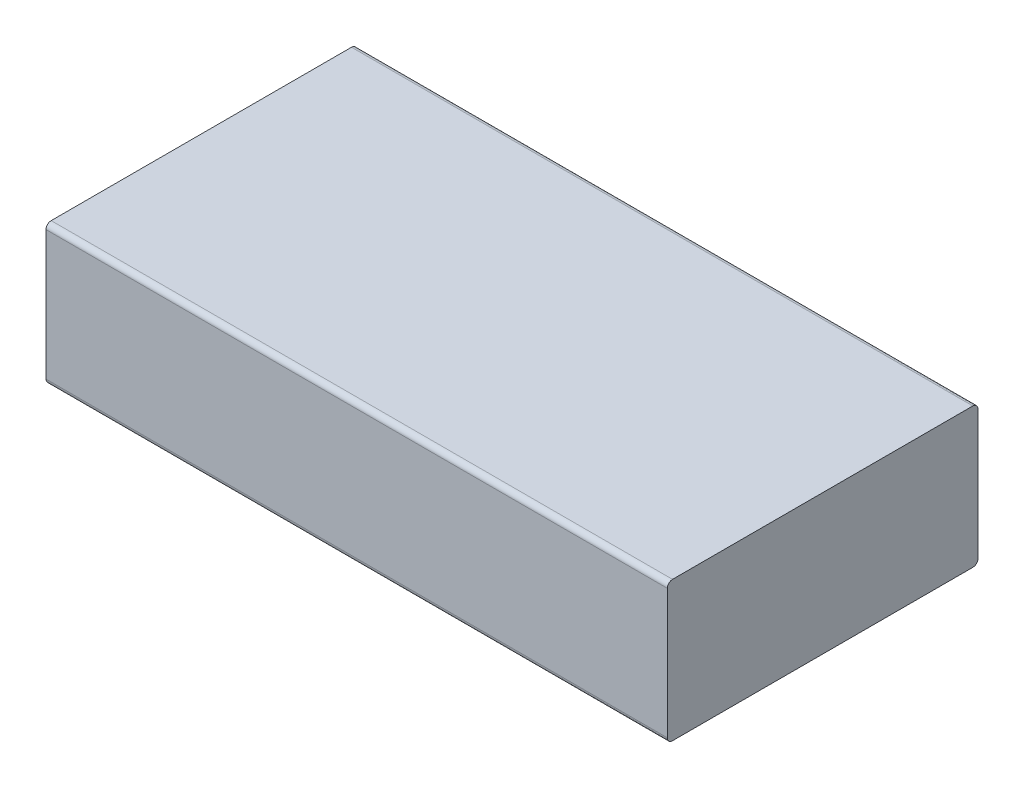
ISO-10303-21;
HEADER;
FILE_DESCRIPTION(('STEP AP214'),'2;1');
FILE_NAME('part.step','',(''),(''),'','','');
FILE_SCHEMA(('AUTOMOTIVE_DESIGN { 1 0 10303 214 1 1 1 1 }'));
ENDSEC;
DATA;
#1=APPLICATION_CONTEXT('core data for automotive mechanical design processes');
#2=APPLICATION_PROTOCOL_DEFINITION('international standard','automotive_design',2000,#1);
#3=PRODUCT_CONTEXT('',#1,'mechanical');
#4=PRODUCT('Part','Part','',(#3));
#5=PRODUCT_RELATED_PRODUCT_CATEGORY('part','',(#4));
#6=PRODUCT_DEFINITION_FORMATION('','',#4);
#7=PRODUCT_DEFINITION_CONTEXT('part definition',#1,'design');
#8=PRODUCT_DEFINITION('design','',#6,#7);
#9=PRODUCT_DEFINITION_SHAPE('','',#8);
#10=(LENGTH_UNIT() NAMED_UNIT(*) SI_UNIT(.MILLI.,.METRE.));
#11=(NAMED_UNIT(*) PLANE_ANGLE_UNIT() SI_UNIT($,.RADIAN.));
#12=(NAMED_UNIT(*) SI_UNIT($,.STERADIAN.) SOLID_ANGLE_UNIT());
#13=UNCERTAINTY_MEASURE_WITH_UNIT(LENGTH_MEASURE(1.E-05),#10,'distance_accuracy_value','');
#14=(GEOMETRIC_REPRESENTATION_CONTEXT(3) GLOBAL_UNCERTAINTY_ASSIGNED_CONTEXT((#13)) GLOBAL_UNIT_ASSIGNED_CONTEXT((#10,
#11,#12)) REPRESENTATION_CONTEXT('',''));
#15=CARTESIAN_POINT('',(0.,0.,0.));
#16=DIRECTION('',(0.,0.,1.));
#17=DIRECTION('',(1.,0.,0.));
#18=AXIS2_PLACEMENT_3D('',#15,#16,#17);
#19=CARTESIAN_POINT('',(60.,0.,0.));
#20=DIRECTION('',(0.,0.,-1.));
#21=DIRECTION('',(-1.,0.,0.));
#22=AXIS2_PLACEMENT_3D('',#19,#20,#21);
#23=PLANE('',#22);
#24=DIRECTION('',(0.,-1.,0.));
#25=VECTOR('',#24,1.);
#26=CARTESIAN_POINT('',(-60.,0.,0.));
#27=LINE('',#26,#25);
#28=CARTESIAN_POINT('',(-60.,26.,0.));
#29=VERTEX_POINT('',#28);
#30=CARTESIAN_POINT('',(-60.,1.,0.));
#31=VERTEX_POINT('',#30);
#32=EDGE_CURVE('E141',#29,#31,#27,.T.);
#33=ORIENTED_EDGE('',*,*,#32,.T.);
#34=DIRECTION('',(-1.,0.,0.));
#35=VECTOR('',#34,1.);
#36=CARTESIAN_POINT('',(60.,1.,0.));
#37=LINE('',#36,#35);
#38=CARTESIAN_POINT('',(60.,1.,0.));
#39=VERTEX_POINT('',#38);
#40=EDGE_CURVE('E11',#31,#39,#37,.F.);
#41=ORIENTED_EDGE('',*,*,#40,.T.);
#42=DIRECTION('',(0.,-1.,0.));
#43=VECTOR('',#42,1.);
#44=CARTESIAN_POINT('',(60.,0.,0.));
#45=LINE('',#44,#43);
#46=CARTESIAN_POINT('',(60.,26.,0.));
#47=VERTEX_POINT('',#46);
#48=EDGE_CURVE('E139',#47,#39,#45,.T.);
#49=ORIENTED_EDGE('',*,*,#48,.F.);
#50=DIRECTION('',(-1.,0.,0.));
#51=VECTOR('',#50,1.);
#52=CARTESIAN_POINT('',(60.,26.,0.));
#53=LINE('',#52,#51);
#54=EDGE_CURVE('E48',#47,#29,#53,.T.);
#55=ORIENTED_EDGE('',*,*,#54,.T.);
#56=EDGE_LOOP('',(#33,#41,#49,#55));
#57=FACE_BOUND('',#56,.T.);
#58=ADVANCED_FACE('F39',(#57),#23,.F.);
#59=CARTESIAN_POINT('',(60.,0.,0.));
#60=DIRECTION('',(0.,1.,0.));
#61=DIRECTION('',(0.,0.,1.));
#62=AXIS2_PLACEMENT_3D('',#59,#60,#61);
#63=PLANE('',#62);
#64=DIRECTION('',(0.,0.,-1.));
#65=VECTOR('',#64,1.);
#66=CARTESIAN_POINT('',(-60.,0.,0.));
#67=LINE('',#66,#65);
#68=CARTESIAN_POINT('',(-60.,0.,-1.));
#69=VERTEX_POINT('',#68);
#70=CARTESIAN_POINT('',(-60.,0.,-59.));
#71=VERTEX_POINT('',#70);
#72=EDGE_CURVE('E135',#69,#71,#67,.T.);
#73=ORIENTED_EDGE('',*,*,#72,.T.);
#74=DIRECTION('',(-1.,0.,0.));
#75=VECTOR('',#74,1.);
#76=CARTESIAN_POINT('',(60.,0.,-59.));
#77=LINE('',#76,#75);
#78=CARTESIAN_POINT('',(60.,0.,-59.));
#79=VERTEX_POINT('',#78);
#80=EDGE_CURVE('E111',#71,#79,#77,.F.);
#81=ORIENTED_EDGE('',*,*,#80,.T.);
#82=DIRECTION('',(0.,0.,-1.));
#83=VECTOR('',#82,1.);
#84=CARTESIAN_POINT('',(60.,0.,0.));
#85=LINE('',#84,#83);
#86=CARTESIAN_POINT('',(60.,0.,-1.));
#87=VERTEX_POINT('',#86);
#88=EDGE_CURVE('E193',#87,#79,#85,.T.);
#89=ORIENTED_EDGE('',*,*,#88,.F.);
#90=DIRECTION('',(-1.,0.,0.));
#91=VECTOR('',#90,1.);
#92=CARTESIAN_POINT('',(60.,0.,-1.));
#93=LINE('',#92,#91);
#94=EDGE_CURVE('E117',#87,#69,#93,.T.);
#95=ORIENTED_EDGE('',*,*,#94,.T.);
#96=EDGE_LOOP('',(#73,#81,#89,#95));
#97=FACE_BOUND('',#96,.T.);
#98=ADVANCED_FACE('F205',(#97),#63,.F.);
#99=CARTESIAN_POINT('',(60.,0.,-60.));
#100=DIRECTION('',(0.,0.,1.));
#101=DIRECTION('',(1.,0.,0.));
#102=AXIS2_PLACEMENT_3D('',#99,#100,#101);
#103=PLANE('',#102);
#104=DIRECTION('',(0.,1.,0.));
#105=VECTOR('',#104,1.);
#106=CARTESIAN_POINT('',(60.,0.,-60.));
#107=LINE('',#106,#105);
#108=CARTESIAN_POINT('',(60.,1.,-60.));
#109=VERTEX_POINT('',#108);
#110=CARTESIAN_POINT('',(60.,26.,-60.));
#111=VERTEX_POINT('',#110);
#112=EDGE_CURVE('E126',#109,#111,#107,.T.);
#113=ORIENTED_EDGE('',*,*,#112,.F.);
#114=DIRECTION('',(-1.,0.,0.));
#115=VECTOR('',#114,1.);
#116=CARTESIAN_POINT('',(60.,1.,-60.));
#117=LINE('',#116,#115);
#118=CARTESIAN_POINT('',(-60.,1.,-60.));
#119=VERTEX_POINT('',#118);
#120=EDGE_CURVE('E110',#109,#119,#117,.T.);
#121=ORIENTED_EDGE('',*,*,#120,.T.);
#122=DIRECTION('',(0.,1.,0.));
#123=VECTOR('',#122,1.);
#124=CARTESIAN_POINT('',(-60.,0.,-60.));
#125=LINE('',#124,#123);
#126=CARTESIAN_POINT('',(-60.,26.,-60.));
#127=VERTEX_POINT('',#126);
#128=EDGE_CURVE('E124',#119,#127,#125,.T.);
#129=ORIENTED_EDGE('',*,*,#128,.T.);
#130=DIRECTION('',(-1.,0.,0.));
#131=VECTOR('',#130,1.);
#132=CARTESIAN_POINT('',(60.,26.,-60.));
#133=LINE('',#132,#131);
#134=EDGE_CURVE('E129',#127,#111,#133,.F.);
#135=ORIENTED_EDGE('',*,*,#134,.T.);
#136=EDGE_LOOP('',(#113,#121,#129,#135));
#137=FACE_BOUND('',#136,.T.);
#138=ADVANCED_FACE('F123',(#137),#103,.F.);
#139=CARTESIAN_POINT('',(60.,27.,0.));
#140=DIRECTION('',(0.,-1.,0.));
#141=DIRECTION('',(0.,0.,-1.));
#142=AXIS2_PLACEMENT_3D('',#139,#140,#141);
#143=PLANE('',#142);
#144=DIRECTION('',(0.,0.,1.));
#145=VECTOR('',#144,1.);
#146=CARTESIAN_POINT('',(60.,27.,0.));
#147=LINE('',#146,#145);
#148=CARTESIAN_POINT('',(60.,27.,-59.));
#149=VERTEX_POINT('',#148);
#150=CARTESIAN_POINT('',(60.,27.,-1.));
#151=VERTEX_POINT('',#150);
#152=EDGE_CURVE('E146',#149,#151,#147,.T.);
#153=ORIENTED_EDGE('',*,*,#152,.F.);
#154=DIRECTION('',(-1.,0.,0.));
#155=VECTOR('',#154,1.);
#156=CARTESIAN_POINT('',(60.,27.,-59.));
#157=LINE('',#156,#155);
#158=CARTESIAN_POINT('',(-60.,27.,-59.));
#159=VERTEX_POINT('',#158);
#160=EDGE_CURVE('E173',#149,#159,#157,.T.);
#161=ORIENTED_EDGE('',*,*,#160,.T.);
#162=DIRECTION('',(0.,0.,1.));
#163=VECTOR('',#162,1.);
#164=CARTESIAN_POINT('',(-60.,27.,0.));
#165=LINE('',#164,#163);
#166=CARTESIAN_POINT('',(-60.,27.,-1.));
#167=VERTEX_POINT('',#166);
#168=EDGE_CURVE('E134',#159,#167,#165,.T.);
#169=ORIENTED_EDGE('',*,*,#168,.T.);
#170=DIRECTION('',(-1.,0.,0.));
#171=VECTOR('',#170,1.);
#172=CARTESIAN_POINT('',(60.,27.,-1.));
#173=LINE('',#172,#171);
#174=EDGE_CURVE('E55',#167,#151,#173,.F.);
#175=ORIENTED_EDGE('',*,*,#174,.T.);
#176=EDGE_LOOP('',(#153,#161,#169,#175));
#177=FACE_BOUND('',#176,.T.);
#178=ADVANCED_FACE('F209',(#177),#143,.F.);
#179=CARTESIAN_POINT('',(60.,0.,0.));
#180=DIRECTION('',(-1.,0.,0.));
#181=DIRECTION('',(0.,0.,1.));
#182=AXIS2_PLACEMENT_3D('',#179,#180,#181);
#183=PLANE('',#182);
#184=ORIENTED_EDGE('',*,*,#88,.T.);
#185=CARTESIAN_POINT('',(60.,1.,-59.));
#186=DIRECTION('',(-1.,0.,0.));
#187=DIRECTION('',(0.,0.,1.));
#188=AXIS2_PLACEMENT_3D('',#185,#186,#187);
#189=CIRCLE('',#188,1.);
#190=EDGE_CURVE('E168',#79,#109,#189,.F.);
#191=ORIENTED_EDGE('',*,*,#190,.T.);
#192=ORIENTED_EDGE('',*,*,#112,.T.);
#193=CARTESIAN_POINT('',(60.,26.,-59.));
#194=DIRECTION('',(-1.,0.,0.));
#195=DIRECTION('',(0.,0.,1.));
#196=AXIS2_PLACEMENT_3D('',#193,#194,#195);
#197=CIRCLE('',#196,1.);
#198=EDGE_CURVE('E62',#111,#149,#197,.F.);
#199=ORIENTED_EDGE('',*,*,#198,.T.);
#200=ORIENTED_EDGE('',*,*,#152,.T.);
#201=CARTESIAN_POINT('',(60.,26.,-1.));
#202=DIRECTION('',(-1.,0.,0.));
#203=DIRECTION('',(0.,0.,1.));
#204=AXIS2_PLACEMENT_3D('',#201,#202,#203);
#205=CIRCLE('',#204,1.);
#206=EDGE_CURVE('E160',#151,#47,#205,.F.);
#207=ORIENTED_EDGE('',*,*,#206,.T.);
#208=ORIENTED_EDGE('',*,*,#48,.T.);
#209=CARTESIAN_POINT('',(60.,1.,-1.));
#210=DIRECTION('',(-1.,0.,0.));
#211=DIRECTION('',(0.,0.,1.));
#212=AXIS2_PLACEMENT_3D('',#209,#210,#211);
#213=CIRCLE('',#212,1.);
#214=EDGE_CURVE('E163',#39,#87,#213,.F.);
#215=ORIENTED_EDGE('',*,*,#214,.T.);
#216=EDGE_LOOP('',(#184,#191,#192,#199,#200,#207,#208,#215));
#217=FACE_BOUND('',#216,.T.);
#218=ADVANCED_FACE('F199',(#217),#183,.F.);
#219=CARTESIAN_POINT('',(-60.,0.,0.));
#220=DIRECTION('',(-1.,0.,0.));
#221=DIRECTION('',(0.,0.,1.));
#222=AXIS2_PLACEMENT_3D('',#219,#220,#221);
#223=PLANE('',#222);
#224=ORIENTED_EDGE('',*,*,#128,.F.);
#225=CARTESIAN_POINT('',(-60.,1.,-59.));
#226=DIRECTION('',(-1.,0.,0.));
#227=DIRECTION('',(0.,0.,1.));
#228=AXIS2_PLACEMENT_3D('',#225,#226,#227);
#229=CIRCLE('',#228,1.);
#230=EDGE_CURVE('E106',#119,#71,#229,.T.);
#231=ORIENTED_EDGE('',*,*,#230,.T.);
#232=ORIENTED_EDGE('',*,*,#72,.F.);
#233=CARTESIAN_POINT('',(-60.,1.,-1.));
#234=DIRECTION('',(-1.,0.,0.));
#235=DIRECTION('',(0.,0.,1.));
#236=AXIS2_PLACEMENT_3D('',#233,#234,#235);
#237=CIRCLE('',#236,1.);
#238=EDGE_CURVE('E150',#69,#31,#237,.T.);
#239=ORIENTED_EDGE('',*,*,#238,.T.);
#240=ORIENTED_EDGE('',*,*,#32,.F.);
#241=CARTESIAN_POINT('',(-60.,26.,-1.));
#242=DIRECTION('',(-1.,0.,0.));
#243=DIRECTION('',(0.,0.,1.));
#244=AXIS2_PLACEMENT_3D('',#241,#242,#243);
#245=CIRCLE('',#244,1.);
#246=EDGE_CURVE('E128',#29,#167,#245,.T.);
#247=ORIENTED_EDGE('',*,*,#246,.T.);
#248=ORIENTED_EDGE('',*,*,#168,.F.);
#249=CARTESIAN_POINT('',(-60.,26.,-59.));
#250=DIRECTION('',(-1.,0.,0.));
#251=DIRECTION('',(0.,0.,1.));
#252=AXIS2_PLACEMENT_3D('',#249,#250,#251);
#253=CIRCLE('',#252,1.);
#254=EDGE_CURVE('E118',#159,#127,#253,.T.);
#255=ORIENTED_EDGE('',*,*,#254,.T.);
#256=EDGE_LOOP('',(#224,#231,#232,#239,#240,#247,#248,#255));
#257=FACE_BOUND('',#256,.T.);
#258=ADVANCED_FACE('F131',(#257),#223,.T.);
#259=CARTESIAN_POINT('',(60.,1.,-59.));
#260=DIRECTION('',(-1.,0.,0.));
#261=DIRECTION('',(0.,0.,1.));
#262=AXIS2_PLACEMENT_3D('',#259,#260,#261);
#263=CYLINDRICAL_SURFACE('',#262,1.);
#264=ORIENTED_EDGE('',*,*,#190,.F.);
#265=ORIENTED_EDGE('',*,*,#80,.F.);
#266=ORIENTED_EDGE('',*,*,#230,.F.);
#267=ORIENTED_EDGE('',*,*,#120,.F.);
#268=EDGE_LOOP('',(#264,#265,#266,#267));
#269=FACE_BOUND('',#268,.T.);
#270=ADVANCED_FACE('F109',(#269),#263,.T.);
#271=CARTESIAN_POINT('',(60.,26.,-59.));
#272=DIRECTION('',(-1.,0.,0.));
#273=DIRECTION('',(0.,0.,1.));
#274=AXIS2_PLACEMENT_3D('',#271,#272,#273);
#275=CYLINDRICAL_SURFACE('',#274,1.);
#276=ORIENTED_EDGE('',*,*,#198,.F.);
#277=ORIENTED_EDGE('',*,*,#134,.F.);
#278=ORIENTED_EDGE('',*,*,#254,.F.);
#279=ORIENTED_EDGE('',*,*,#160,.F.);
#280=EDGE_LOOP('',(#276,#277,#278,#279));
#281=FACE_BOUND('',#280,.T.);
#282=ADVANCED_FACE('F208',(#281),#275,.T.);
#283=CARTESIAN_POINT('',(60.,1.,-1.));
#284=DIRECTION('',(-1.,0.,0.));
#285=DIRECTION('',(0.,0.,1.));
#286=AXIS2_PLACEMENT_3D('',#283,#284,#285);
#287=CYLINDRICAL_SURFACE('',#286,1.);
#288=ORIENTED_EDGE('',*,*,#214,.F.);
#289=ORIENTED_EDGE('',*,*,#40,.F.);
#290=ORIENTED_EDGE('',*,*,#238,.F.);
#291=ORIENTED_EDGE('',*,*,#94,.F.);
#292=EDGE_LOOP('',(#288,#289,#290,#291));
#293=FACE_BOUND('',#292,.T.);
#294=ADVANCED_FACE('F203',(#293),#287,.T.);
#295=CARTESIAN_POINT('',(60.,26.,-1.));
#296=DIRECTION('',(-1.,0.,0.));
#297=DIRECTION('',(0.,0.,1.));
#298=AXIS2_PLACEMENT_3D('',#295,#296,#297);
#299=CYLINDRICAL_SURFACE('',#298,1.);
#300=ORIENTED_EDGE('',*,*,#206,.F.);
#301=ORIENTED_EDGE('',*,*,#174,.F.);
#302=ORIENTED_EDGE('',*,*,#246,.F.);
#303=ORIENTED_EDGE('',*,*,#54,.F.);
#304=EDGE_LOOP('',(#300,#301,#302,#303));
#305=FACE_BOUND('',#304,.T.);
#306=ADVANCED_FACE('F41',(#305),#299,.T.);
#307=CLOSED_SHELL('',(#58,#98,#138,#178,#218,#258,#270,#282,#294,#306));
#308=MANIFOLD_SOLID_BREP('B2',#307);
#309=ADVANCED_BREP_SHAPE_REPRESENTATION('',(#18,#308),#14);
#310=SHAPE_DEFINITION_REPRESENTATION(#9,#309);
ENDSEC;
END-ISO-10303-21;
